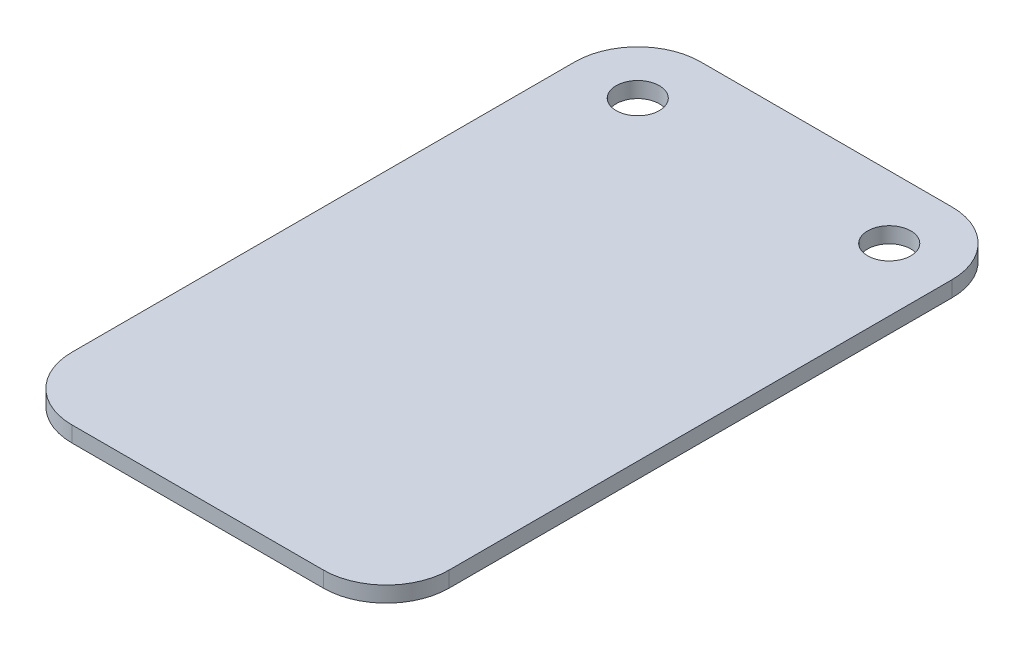
ISO-10303-21;
HEADER;
FILE_DESCRIPTION(('STEP AP214'),'2;1');
FILE_NAME('part.step','',(''),(''),'','','');
FILE_SCHEMA(('AUTOMOTIVE_DESIGN { 1 0 10303 214 1 1 1 1 }'));
ENDSEC;
DATA;
#1=APPLICATION_CONTEXT('core data for automotive mechanical design processes');
#2=APPLICATION_PROTOCOL_DEFINITION('international standard','automotive_design',2000,#1);
#3=PRODUCT_CONTEXT('',#1,'mechanical');
#4=PRODUCT('Part','Part','',(#3));
#5=PRODUCT_RELATED_PRODUCT_CATEGORY('part','',(#4));
#6=PRODUCT_DEFINITION_FORMATION('','',#4);
#7=PRODUCT_DEFINITION_CONTEXT('part definition',#1,'design');
#8=PRODUCT_DEFINITION('design','',#6,#7);
#9=PRODUCT_DEFINITION_SHAPE('','',#8);
#10=(LENGTH_UNIT() NAMED_UNIT(*) SI_UNIT(.MILLI.,.METRE.));
#11=(NAMED_UNIT(*) PLANE_ANGLE_UNIT() SI_UNIT($,.RADIAN.));
#12=(NAMED_UNIT(*) SI_UNIT($,.STERADIAN.) SOLID_ANGLE_UNIT());
#13=UNCERTAINTY_MEASURE_WITH_UNIT(LENGTH_MEASURE(1.E-05),#10,'distance_accuracy_value','');
#14=(GEOMETRIC_REPRESENTATION_CONTEXT(3) GLOBAL_UNCERTAINTY_ASSIGNED_CONTEXT((#13)) GLOBAL_UNIT_ASSIGNED_CONTEXT((#10,
#11,#12)) REPRESENTATION_CONTEXT('',''));
#15=CARTESIAN_POINT('',(0.,0.,0.));
#16=DIRECTION('',(0.,0.,1.));
#17=DIRECTION('',(1.,0.,0.));
#18=AXIS2_PLACEMENT_3D('',#15,#16,#17);
#19=CARTESIAN_POINT('',(6.35,1.5875,-57.15));
#20=DIRECTION('',(0.,1.,0.));
#21=DIRECTION('',(0.,0.,1.));
#22=AXIS2_PLACEMENT_3D('',#19,#20,#21);
#23=PLANE('',#22);
#24=CARTESIAN_POINT('',(31.75,1.5875,-57.15));
#25=DIRECTION('',(0.,1.,0.));
#26=DIRECTION('',(0.,0.,1.));
#27=AXIS2_PLACEMENT_3D('',#24,#25,#26);
#28=CIRCLE('',#27,2.1828125);
#29=CARTESIAN_POINT('',(31.75,1.5875,-54.9671875));
#30=VERTEX_POINT('',#29);
#31=EDGE_CURVE('E139',#30,#30,#28,.T.);
#32=ORIENTED_EDGE('',*,*,#31,.F.);
#33=EDGE_LOOP('',(#32));
#34=FACE_BOUND('',#33,.T.);
#35=CARTESIAN_POINT('',(6.35,1.5875,-57.15));
#36=DIRECTION('',(0.,1.,0.));
#37=DIRECTION('',(0.,0.,1.));
#38=AXIS2_PLACEMENT_3D('',#35,#36,#37);
#39=CIRCLE('',#38,6.35);
#40=CARTESIAN_POINT('',(6.35000000000004,1.5875,-63.5));
#41=VERTEX_POINT('',#40);
#42=CARTESIAN_POINT('',(0.,1.5875,-57.15));
#43=VERTEX_POINT('',#42);
#44=EDGE_CURVE('E150',#41,#43,#39,.T.);
#45=ORIENTED_EDGE('',*,*,#44,.T.);
#46=DIRECTION('',(0.,0.,1.));
#47=VECTOR('',#46,1.);
#48=CARTESIAN_POINT('',(0.,1.5875,-6.35000000000004));
#49=LINE('',#48,#47);
#50=CARTESIAN_POINT('',(0.,1.5875,-6.35000000000004));
#51=VERTEX_POINT('',#50);
#52=EDGE_CURVE('E98',#43,#51,#49,.T.);
#53=ORIENTED_EDGE('',*,*,#52,.T.);
#54=CARTESIAN_POINT('',(6.35,1.5875,-6.35));
#55=DIRECTION('',(0.,1.,0.));
#56=DIRECTION('',(0.,0.,-1.));
#57=AXIS2_PLACEMENT_3D('',#54,#55,#56);
#58=CIRCLE('',#57,6.35);
#59=CARTESIAN_POINT('',(6.35000000000004,1.5875,0.));
#60=VERTEX_POINT('',#59);
#61=EDGE_CURVE('E165',#51,#60,#58,.T.);
#62=ORIENTED_EDGE('',*,*,#61,.T.);
#63=DIRECTION('',(1.,0.,0.));
#64=VECTOR('',#63,1.);
#65=CARTESIAN_POINT('',(6.35000000000004,1.5875,0.));
#66=LINE('',#65,#64);
#67=CARTESIAN_POINT('',(31.75,1.5875,0.));
#68=VERTEX_POINT('',#67);
#69=EDGE_CURVE('E178',#60,#68,#66,.T.);
#70=ORIENTED_EDGE('',*,*,#69,.T.);
#71=CARTESIAN_POINT('',(31.75,1.5875,-6.35));
#72=DIRECTION('',(0.,1.,0.));
#73=DIRECTION('',(0.,0.,-1.));
#74=AXIS2_PLACEMENT_3D('',#71,#72,#73);
#75=CIRCLE('',#74,6.35);
#76=CARTESIAN_POINT('',(38.1,1.5875,-6.35000000000004));
#77=VERTEX_POINT('',#76);
#78=EDGE_CURVE('E117',#68,#77,#75,.T.);
#79=ORIENTED_EDGE('',*,*,#78,.T.);
#80=DIRECTION('',(0.,0.,-1.));
#81=VECTOR('',#80,1.);
#82=CARTESIAN_POINT('',(38.1,1.5875,-6.35000000000004));
#83=LINE('',#82,#81);
#84=CARTESIAN_POINT('',(38.1,1.5875,-57.15));
#85=VERTEX_POINT('',#84);
#86=EDGE_CURVE('E111',#77,#85,#83,.T.);
#87=ORIENTED_EDGE('',*,*,#86,.T.);
#88=CARTESIAN_POINT('',(31.75,1.5875,-57.15));
#89=DIRECTION('',(0.,1.,0.));
#90=DIRECTION('',(0.,0.,1.));
#91=AXIS2_PLACEMENT_3D('',#88,#89,#90);
#92=CIRCLE('',#91,6.35);
#93=CARTESIAN_POINT('',(31.75,1.5875,-63.5));
#94=VERTEX_POINT('',#93);
#95=EDGE_CURVE('E115',#85,#94,#92,.T.);
#96=ORIENTED_EDGE('',*,*,#95,.T.);
#97=DIRECTION('',(-1.,0.,0.));
#98=VECTOR('',#97,1.);
#99=CARTESIAN_POINT('',(6.35000000000004,1.5875,-63.5));
#100=LINE('',#99,#98);
#101=EDGE_CURVE('E55',#94,#41,#100,.T.);
#102=ORIENTED_EDGE('',*,*,#101,.T.);
#103=EDGE_LOOP('',(#45,#53,#62,#70,#79,#87,#96,#102));
#104=FACE_BOUND('',#103,.T.);
#105=CARTESIAN_POINT('',(6.35,1.5875,-57.15));
#106=DIRECTION('',(0.,1.,0.));
#107=DIRECTION('',(0.,0.,1.));
#108=AXIS2_PLACEMENT_3D('',#105,#106,#107);
#109=CIRCLE('',#108,2.1828125);
#110=CARTESIAN_POINT('',(6.35,1.5875,-54.9671875));
#111=VERTEX_POINT('',#110);
#112=EDGE_CURVE('E187',#111,#111,#109,.T.);
#113=ORIENTED_EDGE('',*,*,#112,.F.);
#114=EDGE_LOOP('',(#113));
#115=FACE_BOUND('',#114,.T.);
#116=ADVANCED_FACE('F38',(#34,#104,#115),#23,.T.);
#117=CARTESIAN_POINT('',(6.35,0.,-57.15));
#118=DIRECTION('',(0.,1.,0.));
#119=DIRECTION('',(0.,0.,1.));
#120=AXIS2_PLACEMENT_3D('',#117,#118,#119);
#121=PLANE('',#120);
#122=CARTESIAN_POINT('',(6.35,0.,-57.15));
#123=DIRECTION('',(0.,1.,0.));
#124=DIRECTION('',(0.,0.,1.));
#125=AXIS2_PLACEMENT_3D('',#122,#123,#124);
#126=CIRCLE('',#125,6.35);
#127=CARTESIAN_POINT('',(6.35000000000004,0.,-63.5));
#128=VERTEX_POINT('',#127);
#129=CARTESIAN_POINT('',(0.,0.,-57.15));
#130=VERTEX_POINT('',#129);
#131=EDGE_CURVE('E135',#128,#130,#126,.T.);
#132=ORIENTED_EDGE('',*,*,#131,.F.);
#133=DIRECTION('',(-1.,0.,0.));
#134=VECTOR('',#133,1.);
#135=CARTESIAN_POINT('',(6.35000000000004,0.,-63.5));
#136=LINE('',#135,#134);
#137=CARTESIAN_POINT('',(31.75,0.,-63.5));
#138=VERTEX_POINT('',#137);
#139=EDGE_CURVE('E90',#138,#128,#136,.T.);
#140=ORIENTED_EDGE('',*,*,#139,.F.);
#141=CARTESIAN_POINT('',(31.75,0.,-57.15));
#142=DIRECTION('',(0.,1.,0.));
#143=DIRECTION('',(0.,0.,1.));
#144=AXIS2_PLACEMENT_3D('',#141,#142,#143);
#145=CIRCLE('',#144,6.35);
#146=CARTESIAN_POINT('',(38.1,0.,-57.15));
#147=VERTEX_POINT('',#146);
#148=EDGE_CURVE('E84',#147,#138,#145,.T.);
#149=ORIENTED_EDGE('',*,*,#148,.F.);
#150=DIRECTION('',(0.,0.,-1.));
#151=VECTOR('',#150,1.);
#152=CARTESIAN_POINT('',(38.1,0.,-6.35000000000004));
#153=LINE('',#152,#151);
#154=CARTESIAN_POINT('',(38.1,0.,-6.35000000000004));
#155=VERTEX_POINT('',#154);
#156=EDGE_CURVE('E125',#155,#147,#153,.T.);
#157=ORIENTED_EDGE('',*,*,#156,.F.);
#158=CARTESIAN_POINT('',(31.75,0.,-6.35));
#159=DIRECTION('',(0.,1.,0.));
#160=DIRECTION('',(0.,0.,-1.));
#161=AXIS2_PLACEMENT_3D('',#158,#159,#160);
#162=CIRCLE('',#161,6.35);
#163=CARTESIAN_POINT('',(31.75,0.,0.));
#164=VERTEX_POINT('',#163);
#165=EDGE_CURVE('E145',#164,#155,#162,.T.);
#166=ORIENTED_EDGE('',*,*,#165,.F.);
#167=DIRECTION('',(1.,0.,0.));
#168=VECTOR('',#167,1.);
#169=CARTESIAN_POINT('',(6.35000000000004,0.,0.));
#170=LINE('',#169,#168);
#171=CARTESIAN_POINT('',(6.35000000000004,0.,0.));
#172=VERTEX_POINT('',#171);
#173=EDGE_CURVE('E143',#172,#164,#170,.T.);
#174=ORIENTED_EDGE('',*,*,#173,.F.);
#175=CARTESIAN_POINT('',(6.35,0.,-6.35));
#176=DIRECTION('',(0.,1.,0.));
#177=DIRECTION('',(0.,0.,-1.));
#178=AXIS2_PLACEMENT_3D('',#175,#176,#177);
#179=CIRCLE('',#178,6.35);
#180=CARTESIAN_POINT('',(0.,0.,-6.35000000000004));
#181=VERTEX_POINT('',#180);
#182=EDGE_CURVE('E141',#181,#172,#179,.T.);
#183=ORIENTED_EDGE('',*,*,#182,.F.);
#184=DIRECTION('',(0.,0.,1.));
#185=VECTOR('',#184,1.);
#186=CARTESIAN_POINT('',(0.,0.,-6.35000000000004));
#187=LINE('',#186,#185);
#188=EDGE_CURVE('E138',#130,#181,#187,.T.);
#189=ORIENTED_EDGE('',*,*,#188,.F.);
#190=EDGE_LOOP('',(#132,#140,#149,#157,#166,#174,#183,#189));
#191=FACE_BOUND('',#190,.T.);
#192=CARTESIAN_POINT('',(31.75,0.,-57.15));
#193=DIRECTION('',(0.,1.,0.));
#194=DIRECTION('',(0.,0.,1.));
#195=AXIS2_PLACEMENT_3D('',#192,#193,#194);
#196=CIRCLE('',#195,2.1828125);
#197=CARTESIAN_POINT('',(31.75,0.,-54.9671875));
#198=VERTEX_POINT('',#197);
#199=EDGE_CURVE('E184',#198,#198,#196,.T.);
#200=ORIENTED_EDGE('',*,*,#199,.T.);
#201=EDGE_LOOP('',(#200));
#202=FACE_BOUND('',#201,.T.);
#203=CARTESIAN_POINT('',(6.35,0.,-57.15));
#204=DIRECTION('',(0.,1.,0.));
#205=DIRECTION('',(0.,0.,1.));
#206=AXIS2_PLACEMENT_3D('',#203,#204,#205);
#207=CIRCLE('',#206,2.1828125);
#208=CARTESIAN_POINT('',(6.35,0.,-54.9671875));
#209=VERTEX_POINT('',#208);
#210=EDGE_CURVE('E190',#209,#209,#207,.T.);
#211=ORIENTED_EDGE('',*,*,#210,.T.);
#212=EDGE_LOOP('',(#211));
#213=FACE_BOUND('',#212,.T.);
#214=ADVANCED_FACE('F169',(#191,#202,#213),#121,.F.);
#215=CARTESIAN_POINT('',(6.35,1.5875,-57.15));
#216=DIRECTION('',(0.,-1.,0.));
#217=DIRECTION('',(0.,0.,-1.));
#218=AXIS2_PLACEMENT_3D('',#215,#216,#217);
#219=CYLINDRICAL_SURFACE('',#218,6.35);
#220=ORIENTED_EDGE('',*,*,#131,.T.);
#221=DIRECTION('',(0.,-1.,0.));
#222=VECTOR('',#221,1.);
#223=CARTESIAN_POINT('',(0.,1.5875,-57.15));
#224=LINE('',#223,#222);
#225=EDGE_CURVE('E11',#43,#130,#224,.T.);
#226=ORIENTED_EDGE('',*,*,#225,.F.);
#227=ORIENTED_EDGE('',*,*,#44,.F.);
#228=DIRECTION('',(0.,-1.,0.));
#229=VECTOR('',#228,1.);
#230=CARTESIAN_POINT('',(6.35000000000004,1.5875,-63.5));
#231=LINE('',#230,#229);
#232=EDGE_CURVE('E131',#41,#128,#231,.T.);
#233=ORIENTED_EDGE('',*,*,#232,.T.);
#234=EDGE_LOOP('',(#220,#226,#227,#233));
#235=FACE_BOUND('',#234,.T.);
#236=ADVANCED_FACE('F40',(#235),#219,.T.);
#237=CARTESIAN_POINT('',(0.,1.5875,-6.35000000000004));
#238=DIRECTION('',(1.,0.,0.));
#239=DIRECTION('',(0.,0.,-1.));
#240=AXIS2_PLACEMENT_3D('',#237,#238,#239);
#241=PLANE('',#240);
#242=ORIENTED_EDGE('',*,*,#188,.T.);
#243=DIRECTION('',(0.,-1.,0.));
#244=VECTOR('',#243,1.);
#245=CARTESIAN_POINT('',(0.,1.5875,-6.35000000000004));
#246=LINE('',#245,#244);
#247=EDGE_CURVE('E47',#51,#181,#246,.T.);
#248=ORIENTED_EDGE('',*,*,#247,.F.);
#249=ORIENTED_EDGE('',*,*,#52,.F.);
#250=ORIENTED_EDGE('',*,*,#225,.T.);
#251=EDGE_LOOP('',(#242,#248,#249,#250));
#252=FACE_BOUND('',#251,.T.);
#253=ADVANCED_FACE('F222',(#252),#241,.F.);
#254=CARTESIAN_POINT('',(6.35,1.5875,-6.35));
#255=DIRECTION('',(0.,-1.,0.));
#256=DIRECTION('',(0.,0.,-1.));
#257=AXIS2_PLACEMENT_3D('',#254,#255,#256);
#258=CYLINDRICAL_SURFACE('',#257,6.35);
#259=ORIENTED_EDGE('',*,*,#182,.T.);
#260=DIRECTION('',(0.,-1.,0.));
#261=VECTOR('',#260,1.);
#262=CARTESIAN_POINT('',(6.35000000000004,1.5875,0.));
#263=LINE('',#262,#261);
#264=EDGE_CURVE('E157',#60,#172,#263,.T.);
#265=ORIENTED_EDGE('',*,*,#264,.F.);
#266=ORIENTED_EDGE('',*,*,#61,.F.);
#267=ORIENTED_EDGE('',*,*,#247,.T.);
#268=EDGE_LOOP('',(#259,#265,#266,#267));
#269=FACE_BOUND('',#268,.T.);
#270=ADVANCED_FACE('F163',(#269),#258,.T.);
#271=CARTESIAN_POINT('',(6.35000000000004,1.5875,0.));
#272=DIRECTION('',(0.,0.,-1.));
#273=DIRECTION('',(-1.,0.,0.));
#274=AXIS2_PLACEMENT_3D('',#271,#272,#273);
#275=PLANE('',#274);
#276=ORIENTED_EDGE('',*,*,#173,.T.);
#277=DIRECTION('',(0.,-1.,0.));
#278=VECTOR('',#277,1.);
#279=CARTESIAN_POINT('',(31.75,1.5875,0.));
#280=LINE('',#279,#278);
#281=EDGE_CURVE('E154',#68,#164,#280,.T.);
#282=ORIENTED_EDGE('',*,*,#281,.F.);
#283=ORIENTED_EDGE('',*,*,#69,.F.);
#284=ORIENTED_EDGE('',*,*,#264,.T.);
#285=EDGE_LOOP('',(#276,#282,#283,#284));
#286=FACE_BOUND('',#285,.T.);
#287=ADVANCED_FACE('F174',(#286),#275,.F.);
#288=CARTESIAN_POINT('',(31.75,1.5875,-6.35));
#289=DIRECTION('',(0.,-1.,0.));
#290=DIRECTION('',(0.,0.,-1.));
#291=AXIS2_PLACEMENT_3D('',#288,#289,#290);
#292=CYLINDRICAL_SURFACE('',#291,6.35);
#293=ORIENTED_EDGE('',*,*,#165,.T.);
#294=DIRECTION('',(0.,-1.,0.));
#295=VECTOR('',#294,1.);
#296=CARTESIAN_POINT('',(38.1,1.5875,-6.35000000000004));
#297=LINE('',#296,#295);
#298=EDGE_CURVE('E126',#77,#155,#297,.T.);
#299=ORIENTED_EDGE('',*,*,#298,.F.);
#300=ORIENTED_EDGE('',*,*,#78,.F.);
#301=ORIENTED_EDGE('',*,*,#281,.T.);
#302=EDGE_LOOP('',(#293,#299,#300,#301));
#303=FACE_BOUND('',#302,.T.);
#304=ADVANCED_FACE('F177',(#303),#292,.T.);
#305=CARTESIAN_POINT('',(38.1,1.5875,-6.35000000000004));
#306=DIRECTION('',(-1.,0.,0.));
#307=DIRECTION('',(0.,0.,1.));
#308=AXIS2_PLACEMENT_3D('',#305,#306,#307);
#309=PLANE('',#308);
#310=ORIENTED_EDGE('',*,*,#156,.T.);
#311=DIRECTION('',(0.,-1.,0.));
#312=VECTOR('',#311,1.);
#313=CARTESIAN_POINT('',(38.1,1.5875,-57.15));
#314=LINE('',#313,#312);
#315=EDGE_CURVE('E122',#85,#147,#314,.T.);
#316=ORIENTED_EDGE('',*,*,#315,.F.);
#317=ORIENTED_EDGE('',*,*,#86,.F.);
#318=ORIENTED_EDGE('',*,*,#298,.T.);
#319=EDGE_LOOP('',(#310,#316,#317,#318));
#320=FACE_BOUND('',#319,.T.);
#321=ADVANCED_FACE('F123',(#320),#309,.F.);
#322=CARTESIAN_POINT('',(31.75,1.5875,-57.15));
#323=DIRECTION('',(0.,-1.,0.));
#324=DIRECTION('',(0.,0.,-1.));
#325=AXIS2_PLACEMENT_3D('',#322,#323,#324);
#326=CYLINDRICAL_SURFACE('',#325,6.35);
#327=ORIENTED_EDGE('',*,*,#148,.T.);
#328=DIRECTION('',(0.,-1.,0.));
#329=VECTOR('',#328,1.);
#330=CARTESIAN_POINT('',(31.75,1.5875,-63.5));
#331=LINE('',#330,#329);
#332=EDGE_CURVE('E127',#94,#138,#331,.T.);
#333=ORIENTED_EDGE('',*,*,#332,.F.);
#334=ORIENTED_EDGE('',*,*,#95,.F.);
#335=ORIENTED_EDGE('',*,*,#315,.T.);
#336=EDGE_LOOP('',(#327,#333,#334,#335));
#337=FACE_BOUND('',#336,.T.);
#338=ADVANCED_FACE('F129',(#337),#326,.T.);
#339=CARTESIAN_POINT('',(6.35000000000004,1.5875,-63.5));
#340=DIRECTION('',(0.,0.,1.));
#341=DIRECTION('',(1.,0.,0.));
#342=AXIS2_PLACEMENT_3D('',#339,#340,#341);
#343=PLANE('',#342);
#344=ORIENTED_EDGE('',*,*,#139,.T.);
#345=ORIENTED_EDGE('',*,*,#232,.F.);
#346=ORIENTED_EDGE('',*,*,#101,.F.);
#347=ORIENTED_EDGE('',*,*,#332,.T.);
#348=EDGE_LOOP('',(#344,#345,#346,#347));
#349=FACE_BOUND('',#348,.T.);
#350=ADVANCED_FACE('F210',(#349),#343,.F.);
#351=CARTESIAN_POINT('',(31.75,1.5875,-57.15));
#352=DIRECTION('',(0.,-1.,0.));
#353=DIRECTION('',(0.,0.,-1.));
#354=AXIS2_PLACEMENT_3D('',#351,#352,#353);
#355=CYLINDRICAL_SURFACE('',#354,2.1828125);
#356=ORIENTED_EDGE('',*,*,#31,.T.);
#357=EDGE_LOOP('',(#356));
#358=FACE_BOUND('',#357,.T.);
#359=ORIENTED_EDGE('',*,*,#199,.F.);
#360=EDGE_LOOP('',(#359));
#361=FACE_BOUND('',#360,.T.);
#362=ADVANCED_FACE('F207',(#358,#361),#355,.F.);
#363=CARTESIAN_POINT('',(6.35,1.5875,-57.15));
#364=DIRECTION('',(0.,-1.,0.));
#365=DIRECTION('',(0.,0.,-1.));
#366=AXIS2_PLACEMENT_3D('',#363,#364,#365);
#367=CYLINDRICAL_SURFACE('',#366,2.1828125);
#368=ORIENTED_EDGE('',*,*,#112,.T.);
#369=EDGE_LOOP('',(#368));
#370=FACE_BOUND('',#369,.T.);
#371=ORIENTED_EDGE('',*,*,#210,.F.);
#372=EDGE_LOOP('',(#371));
#373=FACE_BOUND('',#372,.T.);
#374=ADVANCED_FACE('F196',(#370,#373),#367,.F.);
#375=CLOSED_SHELL('',(#116,#214,#236,#253,#270,#287,#304,#321,#338,#350,#362,#374));
#376=MANIFOLD_SOLID_BREP('B2',#375);
#377=ADVANCED_BREP_SHAPE_REPRESENTATION('',(#18,#376),#14);
#378=SHAPE_DEFINITION_REPRESENTATION(#9,#377);
ENDSEC;
END-ISO-10303-21;
